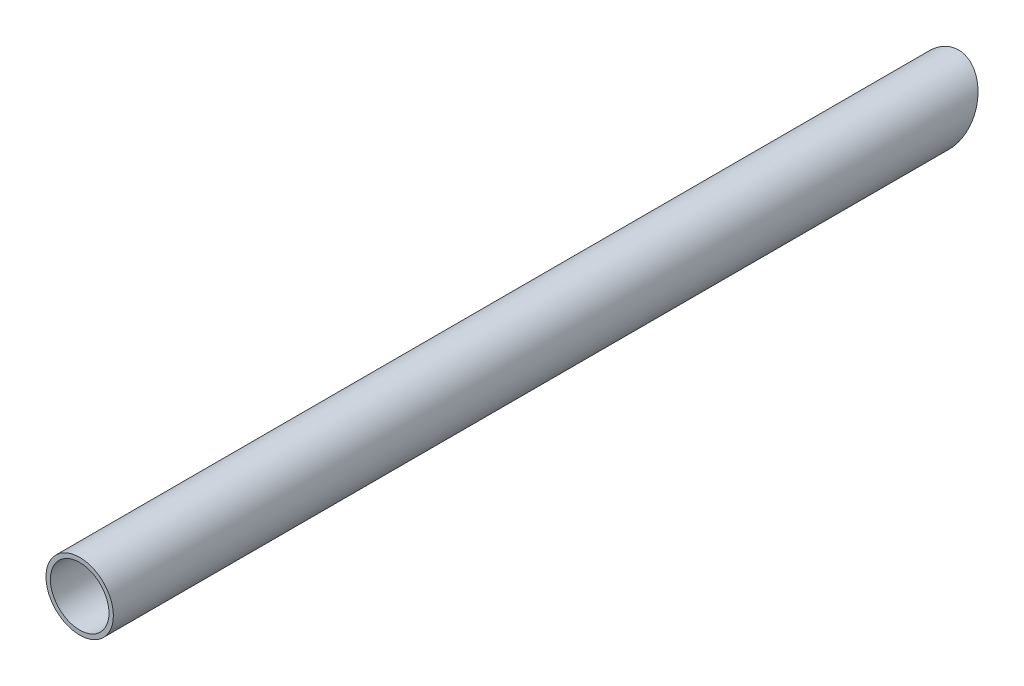
ISO-10303-21;
HEADER;
FILE_DESCRIPTION(('STEP AP214'),'2;1');
FILE_NAME('part.step','',(''),(''),'','','');
FILE_SCHEMA(('AUTOMOTIVE_DESIGN { 1 0 10303 214 1 1 1 1 }'));
ENDSEC;
DATA;
#1=APPLICATION_CONTEXT('core data for automotive mechanical design processes');
#2=APPLICATION_PROTOCOL_DEFINITION('international standard','automotive_design',2000,#1);
#3=PRODUCT_CONTEXT('',#1,'mechanical');
#4=PRODUCT('Part','Part','',(#3));
#5=PRODUCT_RELATED_PRODUCT_CATEGORY('part','',(#4));
#6=PRODUCT_DEFINITION_FORMATION('','',#4);
#7=PRODUCT_DEFINITION_CONTEXT('part definition',#1,'design');
#8=PRODUCT_DEFINITION('design','',#6,#7);
#9=PRODUCT_DEFINITION_SHAPE('','',#8);
#10=(LENGTH_UNIT() NAMED_UNIT(*) SI_UNIT(.MILLI.,.METRE.));
#11=(NAMED_UNIT(*) PLANE_ANGLE_UNIT() SI_UNIT($,.RADIAN.));
#12=(NAMED_UNIT(*) SI_UNIT($,.STERADIAN.) SOLID_ANGLE_UNIT());
#13=UNCERTAINTY_MEASURE_WITH_UNIT(LENGTH_MEASURE(1.E-05),#10,'distance_accuracy_value','');
#14=(GEOMETRIC_REPRESENTATION_CONTEXT(3) GLOBAL_UNCERTAINTY_ASSIGNED_CONTEXT((#13)) GLOBAL_UNIT_ASSIGNED_CONTEXT((#10,
#11,#12)) REPRESENTATION_CONTEXT('',''));
#15=CARTESIAN_POINT('',(0.,0.,0.));
#16=DIRECTION('',(0.,0.,1.));
#17=DIRECTION('',(1.,0.,0.));
#18=AXIS2_PLACEMENT_3D('',#15,#16,#17);
#19=CARTESIAN_POINT('',(0.,0.,150.));
#20=DIRECTION('',(0.,0.,1.));
#21=DIRECTION('',(1.,0.,0.));
#22=AXIS2_PLACEMENT_3D('',#19,#20,#21);
#23=PLANE('',#22);
#24=CARTESIAN_POINT('',(0.,0.,150.));
#25=DIRECTION('',(0.,0.,1.));
#26=DIRECTION('',(1.,0.,0.));
#27=AXIS2_PLACEMENT_3D('',#24,#25,#26);
#28=CIRCLE('',#27,11.5);
#29=CARTESIAN_POINT('',(11.5,0.,150.));
#30=VERTEX_POINT('',#29);
#31=EDGE_CURVE('E10',#30,#30,#28,.T.);
#32=ORIENTED_EDGE('',*,*,#31,.T.);
#33=EDGE_LOOP('',(#32));
#34=FACE_BOUND('',#33,.T.);
#35=CARTESIAN_POINT('',(0.,0.,150.));
#36=DIRECTION('',(0.,0.,1.));
#37=DIRECTION('',(1.,0.,0.));
#38=AXIS2_PLACEMENT_3D('',#35,#36,#37);
#39=CIRCLE('',#38,10.);
#40=CARTESIAN_POINT('',(10.,0.,150.));
#41=VERTEX_POINT('',#40);
#42=EDGE_CURVE('E44',#41,#41,#39,.T.);
#43=ORIENTED_EDGE('',*,*,#42,.F.);
#44=EDGE_LOOP('',(#43));
#45=FACE_BOUND('',#44,.T.);
#46=ADVANCED_FACE('F36',(#34,#45),#23,.T.);
#47=CARTESIAN_POINT('',(0.,0.,150.));
#48=DIRECTION('',(0.,0.,-1.));
#49=DIRECTION('',(-1.,0.,0.));
#50=AXIS2_PLACEMENT_3D('',#47,#48,#49);
#51=CYLINDRICAL_SURFACE('',#50,11.5);
#52=ORIENTED_EDGE('',*,*,#31,.F.);
#53=EDGE_LOOP('',(#52));
#54=FACE_BOUND('',#53,.T.);
#55=CARTESIAN_POINT('',(0.,0.,-143.360471904319));
#56=DIRECTION('',(0.,0.500000000000004,0.866025403784436));
#57=DIRECTION('',(0.,0.866025403784436,-0.500000000000005));
#58=AXIS2_PLACEMENT_3D('',#55,#56,#57);
#59=ELLIPSE('',#58,13.2790561913614,11.5);
#60=CARTESIAN_POINT('',(0.,11.5,-150.));
#61=VERTEX_POINT('',#60);
#62=EDGE_CURVE('E48',#61,#61,#59,.T.);
#63=ORIENTED_EDGE('',*,*,#62,.T.);
#64=EDGE_LOOP('',(#63));
#65=FACE_BOUND('',#64,.T.);
#66=ADVANCED_FACE('F38',(#54,#65),#51,.T.);
#67=CARTESIAN_POINT('',(0.,0.,150.));
#68=DIRECTION('',(0.,0.,-1.));
#69=DIRECTION('',(-1.,0.,0.));
#70=AXIS2_PLACEMENT_3D('',#67,#68,#69);
#71=CYLINDRICAL_SURFACE('',#70,10.);
#72=CARTESIAN_POINT('',(0.,0.,-143.360471904319));
#73=DIRECTION('',(0.,0.500000000000004,0.866025403784436));
#74=DIRECTION('',(0.,0.866025403784436,-0.500000000000005));
#75=AXIS2_PLACEMENT_3D('',#72,#73,#74);
#76=ELLIPSE('',#75,11.5470053837925,10.);
#77=CARTESIAN_POINT('',(0.,10.,-149.133974596216));
#78=VERTEX_POINT('',#77);
#79=EDGE_CURVE('E40',#78,#78,#76,.T.);
#80=ORIENTED_EDGE('',*,*,#79,.F.);
#81=EDGE_LOOP('',(#80));
#82=FACE_BOUND('',#81,.T.);
#83=ORIENTED_EDGE('',*,*,#42,.T.);
#84=EDGE_LOOP('',(#83));
#85=FACE_BOUND('',#84,.T.);
#86=ADVANCED_FACE('F60',(#82,#85),#71,.F.);
#87=CARTESIAN_POINT('',(-150.,11.5,-150.));
#88=DIRECTION('',(0.,0.500000000000004,0.866025403784436));
#89=DIRECTION('',(0.,-0.866025403784436,0.500000000000005));
#90=AXIS2_PLACEMENT_3D('',#87,#88,#89);
#91=PLANE('',#90);
#92=ORIENTED_EDGE('',*,*,#79,.T.);
#93=EDGE_LOOP('',(#92));
#94=FACE_BOUND('',#93,.T.);
#95=ORIENTED_EDGE('',*,*,#62,.F.);
#96=EDGE_LOOP('',(#95));
#97=FACE_BOUND('',#96,.T.);
#98=ADVANCED_FACE('F57',(#94,#97),#91,.F.);
#99=CLOSED_SHELL('',(#46,#66,#86,#98));
#100=MANIFOLD_SOLID_BREP('B2',#99);
#101=ADVANCED_BREP_SHAPE_REPRESENTATION('',(#18,#100),#14);
#102=SHAPE_DEFINITION_REPRESENTATION(#9,#101);
ENDSEC;
END-ISO-10303-21;
